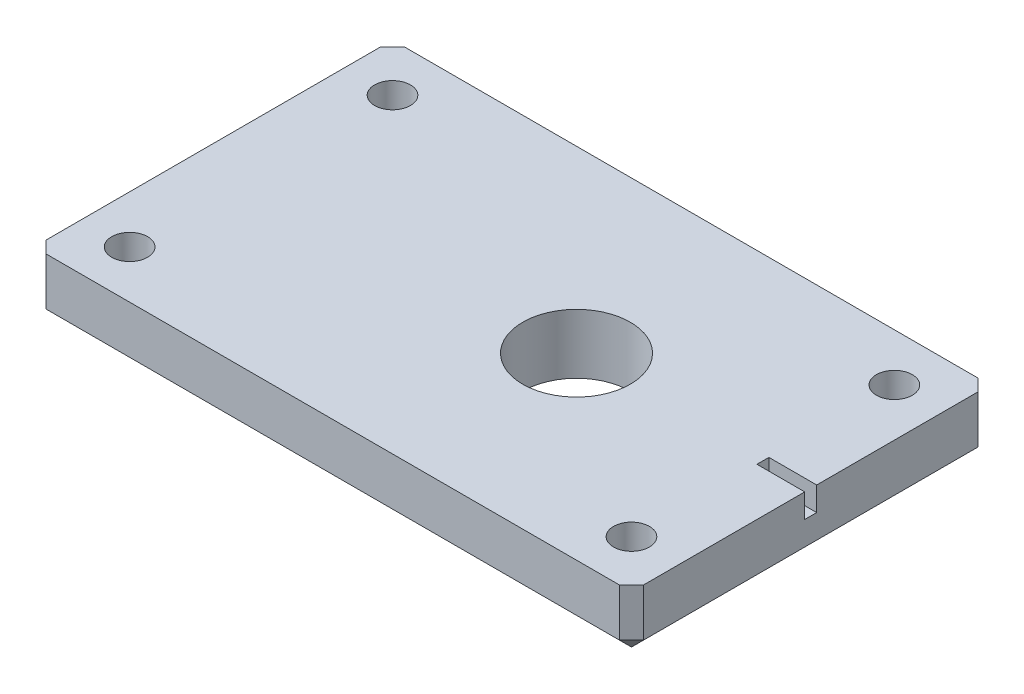
ISO-10303-21;
HEADER;
FILE_DESCRIPTION(('STEP AP214'),'2;1');
FILE_NAME('part.step','',(''),(''),'','','');
FILE_SCHEMA(('AUTOMOTIVE_DESIGN { 1 0 10303 214 1 1 1 1 }'));
ENDSEC;
DATA;
#1=APPLICATION_CONTEXT('core data for automotive mechanical design processes');
#2=APPLICATION_PROTOCOL_DEFINITION('international standard','automotive_design',2000,#1);
#3=PRODUCT_CONTEXT('',#1,'mechanical');
#4=PRODUCT('Part','Part','',(#3));
#5=PRODUCT_RELATED_PRODUCT_CATEGORY('part','',(#4));
#6=PRODUCT_DEFINITION_FORMATION('','',#4);
#7=PRODUCT_DEFINITION_CONTEXT('part definition',#1,'design');
#8=PRODUCT_DEFINITION('design','',#6,#7);
#9=PRODUCT_DEFINITION_SHAPE('','',#8);
#10=(LENGTH_UNIT() NAMED_UNIT(*) SI_UNIT(.MILLI.,.METRE.));
#11=(NAMED_UNIT(*) PLANE_ANGLE_UNIT() SI_UNIT($,.RADIAN.));
#12=(NAMED_UNIT(*) SI_UNIT($,.STERADIAN.) SOLID_ANGLE_UNIT());
#13=UNCERTAINTY_MEASURE_WITH_UNIT(LENGTH_MEASURE(1.E-05),#10,'distance_accuracy_value','');
#14=(GEOMETRIC_REPRESENTATION_CONTEXT(3) GLOBAL_UNCERTAINTY_ASSIGNED_CONTEXT((#13)) GLOBAL_UNIT_ASSIGNED_CONTEXT((#10,
#11,#12)) REPRESENTATION_CONTEXT('',''));
#15=CARTESIAN_POINT('',(0.,0.,0.));
#16=DIRECTION('',(0.,0.,1.));
#17=DIRECTION('',(1.,0.,0.));
#18=AXIS2_PLACEMENT_3D('',#15,#16,#17);
#19=CARTESIAN_POINT('',(25.,5.,-15.));
#20=DIRECTION('',(-1.,0.,0.));
#21=DIRECTION('',(0.,0.,1.));
#22=AXIS2_PLACEMENT_3D('',#19,#20,#21);
#23=PLANE('',#22);
#24=DIRECTION('',(0.,0.,-1.));
#25=VECTOR('',#24,1.);
#26=CARTESIAN_POINT('',(25.,5.,-15.));
#27=LINE('',#26,#25);
#28=CARTESIAN_POINT('',(25.,5.,14.));
#29=VERTEX_POINT('',#28);
#30=CARTESIAN_POINT('',(25.,5.,0.499999999999993));
#31=VERTEX_POINT('',#30);
#32=EDGE_CURVE('E170',#29,#31,#27,.T.);
#33=ORIENTED_EDGE('',*,*,#32,.F.);
#34=DIRECTION('',(0.,-1.,0.));
#35=VECTOR('',#34,1.);
#36=CARTESIAN_POINT('',(25.,5.,14.));
#37=LINE('',#36,#35);
#38=CARTESIAN_POINT('',(25.,1.00000000000001,14.));
#39=VERTEX_POINT('',#38);
#40=EDGE_CURVE('E230',#29,#39,#37,.T.);
#41=ORIENTED_EDGE('',*,*,#40,.T.);
#42=DIRECTION('',(0.,0.,-1.));
#43=VECTOR('',#42,1.);
#44=CARTESIAN_POINT('',(25.,1.00000000000001,-15.));
#45=LINE('',#44,#43);
#46=CARTESIAN_POINT('',(25.,1.00000000000001,-14.));
#47=VERTEX_POINT('',#46);
#48=EDGE_CURVE('E226',#39,#47,#45,.T.);
#49=ORIENTED_EDGE('',*,*,#48,.T.);
#50=DIRECTION('',(0.,1.,0.));
#51=VECTOR('',#50,1.);
#52=CARTESIAN_POINT('',(25.,5.,-14.));
#53=LINE('',#52,#51);
#54=CARTESIAN_POINT('',(25.,5.,-14.));
#55=VERTEX_POINT('',#54);
#56=EDGE_CURVE('E228',#47,#55,#53,.T.);
#57=ORIENTED_EDGE('',*,*,#56,.T.);
#58=CARTESIAN_POINT('',(25.,5.,-0.500000000000007));
#59=VERTEX_POINT('',#58);
#60=EDGE_CURVE('E163',#59,#55,#27,.T.);
#61=ORIENTED_EDGE('',*,*,#60,.F.);
#62=DIRECTION('',(0.,1.,0.));
#63=VECTOR('',#62,1.);
#64=CARTESIAN_POINT('',(25.,3.,-0.500000000000007));
#65=LINE('',#64,#63);
#66=CARTESIAN_POINT('',(25.,3.,-0.500000000000007));
#67=VERTEX_POINT('',#66);
#68=EDGE_CURVE('E142',#67,#59,#65,.T.);
#69=ORIENTED_EDGE('',*,*,#68,.F.);
#70=DIRECTION('',(0.,0.,-1.));
#71=VECTOR('',#70,1.);
#72=CARTESIAN_POINT('',(25.,3.,-0.500000000000007));
#73=LINE('',#72,#71);
#74=CARTESIAN_POINT('',(25.,3.,0.499999999999993));
#75=VERTEX_POINT('',#74);
#76=EDGE_CURVE('E149',#75,#67,#73,.T.);
#77=ORIENTED_EDGE('',*,*,#76,.F.);
#78=DIRECTION('',(0.,1.,0.));
#79=VECTOR('',#78,1.);
#80=CARTESIAN_POINT('',(25.,3.,0.499999999999993));
#81=LINE('',#80,#79);
#82=EDGE_CURVE('E291',#75,#31,#81,.T.);
#83=ORIENTED_EDGE('',*,*,#82,.T.);
#84=EDGE_LOOP('',(#33,#41,#49,#57,#61,#69,#77,#83));
#85=FACE_BOUND('',#84,.T.);
#86=ADVANCED_FACE('F37',(#85),#23,.F.);
#87=CARTESIAN_POINT('',(-25.,5.,-15.));
#88=DIRECTION('',(0.,0.,1.));
#89=DIRECTION('',(1.,0.,0.));
#90=AXIS2_PLACEMENT_3D('',#87,#88,#89);
#91=PLANE('',#90);
#92=DIRECTION('',(-1.,0.,0.));
#93=VECTOR('',#92,1.);
#94=CARTESIAN_POINT('',(-25.,1.00000000000001,-15.));
#95=LINE('',#94,#93);
#96=CARTESIAN_POINT('',(24.,1.00000000000001,-15.));
#97=VERTEX_POINT('',#96);
#98=CARTESIAN_POINT('',(-24.,1.00000000000001,-15.));
#99=VERTEX_POINT('',#98);
#100=EDGE_CURVE('E206',#97,#99,#95,.T.);
#101=ORIENTED_EDGE('',*,*,#100,.T.);
#102=DIRECTION('',(0.,1.,0.));
#103=VECTOR('',#102,1.);
#104=CARTESIAN_POINT('',(-24.,5.,-15.));
#105=LINE('',#104,#103);
#106=CARTESIAN_POINT('',(-24.,5.,-15.));
#107=VERTEX_POINT('',#106);
#108=EDGE_CURVE('E210',#99,#107,#105,.T.);
#109=ORIENTED_EDGE('',*,*,#108,.T.);
#110=DIRECTION('',(-1.,0.,0.));
#111=VECTOR('',#110,1.);
#112=CARTESIAN_POINT('',(-25.,5.,-15.));
#113=LINE('',#112,#111);
#114=CARTESIAN_POINT('',(24.,5.,-15.));
#115=VERTEX_POINT('',#114);
#116=EDGE_CURVE('E172',#115,#107,#113,.T.);
#117=ORIENTED_EDGE('',*,*,#116,.F.);
#118=DIRECTION('',(0.,-1.,0.));
#119=VECTOR('',#118,1.);
#120=CARTESIAN_POINT('',(24.,5.,-15.));
#121=LINE('',#120,#119);
#122=EDGE_CURVE('E208',#115,#97,#121,.T.);
#123=ORIENTED_EDGE('',*,*,#122,.T.);
#124=EDGE_LOOP('',(#101,#109,#117,#123));
#125=FACE_BOUND('',#124,.T.);
#126=ADVANCED_FACE('F319',(#125),#91,.F.);
#127=CARTESIAN_POINT('',(-25.,5.,-15.));
#128=DIRECTION('',(1.,0.,0.));
#129=DIRECTION('',(0.,0.,-1.));
#130=AXIS2_PLACEMENT_3D('',#127,#128,#129);
#131=PLANE('',#130);
#132=DIRECTION('',(0.,0.,1.));
#133=VECTOR('',#132,1.);
#134=CARTESIAN_POINT('',(-25.,5.,-15.));
#135=LINE('',#134,#133);
#136=CARTESIAN_POINT('',(-25.,5.,-14.));
#137=VERTEX_POINT('',#136);
#138=CARTESIAN_POINT('',(-25.,5.,14.));
#139=VERTEX_POINT('',#138);
#140=EDGE_CURVE('E175',#137,#139,#135,.T.);
#141=ORIENTED_EDGE('',*,*,#140,.F.);
#142=DIRECTION('',(0.,-1.,0.));
#143=VECTOR('',#142,1.);
#144=CARTESIAN_POINT('',(-25.,5.,-14.));
#145=LINE('',#144,#143);
#146=CARTESIAN_POINT('',(-25.,1.00000000000001,-14.));
#147=VERTEX_POINT('',#146);
#148=EDGE_CURVE('E203',#137,#147,#145,.T.);
#149=ORIENTED_EDGE('',*,*,#148,.T.);
#150=DIRECTION('',(0.,0.,1.));
#151=VECTOR('',#150,1.);
#152=CARTESIAN_POINT('',(-25.,1.00000000000001,-15.));
#153=LINE('',#152,#151);
#154=CARTESIAN_POINT('',(-25.,1.00000000000001,14.));
#155=VERTEX_POINT('',#154);
#156=EDGE_CURVE('E181',#147,#155,#153,.T.);
#157=ORIENTED_EDGE('',*,*,#156,.T.);
#158=DIRECTION('',(0.,1.,0.));
#159=VECTOR('',#158,1.);
#160=CARTESIAN_POINT('',(-25.,5.,14.));
#161=LINE('',#160,#159);
#162=EDGE_CURVE('E201',#155,#139,#161,.T.);
#163=ORIENTED_EDGE('',*,*,#162,.T.);
#164=EDGE_LOOP('',(#141,#149,#157,#163));
#165=FACE_BOUND('',#164,.T.);
#166=ADVANCED_FACE('F339',(#165),#131,.F.);
#167=CARTESIAN_POINT('',(-25.,5.,15.));
#168=DIRECTION('',(0.,0.,-1.));
#169=DIRECTION('',(-1.,0.,0.));
#170=AXIS2_PLACEMENT_3D('',#167,#168,#169);
#171=PLANE('',#170);
#172=DIRECTION('',(1.,0.,0.));
#173=VECTOR('',#172,1.);
#174=CARTESIAN_POINT('',(-25.,5.,15.));
#175=LINE('',#174,#173);
#176=CARTESIAN_POINT('',(-24.,5.,15.));
#177=VERTEX_POINT('',#176);
#178=CARTESIAN_POINT('',(24.,5.,15.));
#179=VERTEX_POINT('',#178);
#180=EDGE_CURVE('E178',#177,#179,#175,.T.);
#181=ORIENTED_EDGE('',*,*,#180,.F.);
#182=DIRECTION('',(0.,-1.,0.));
#183=VECTOR('',#182,1.);
#184=CARTESIAN_POINT('',(-24.,5.,15.));
#185=LINE('',#184,#183);
#186=CARTESIAN_POINT('',(-24.,1.00000000000001,15.));
#187=VERTEX_POINT('',#186);
#188=EDGE_CURVE('E224',#177,#187,#185,.T.);
#189=ORIENTED_EDGE('',*,*,#188,.T.);
#190=DIRECTION('',(1.,0.,0.));
#191=VECTOR('',#190,1.);
#192=CARTESIAN_POINT('',(-25.,1.00000000000001,15.));
#193=LINE('',#192,#191);
#194=CARTESIAN_POINT('',(24.,1.00000000000001,15.));
#195=VERTEX_POINT('',#194);
#196=EDGE_CURVE('E220',#187,#195,#193,.T.);
#197=ORIENTED_EDGE('',*,*,#196,.T.);
#198=DIRECTION('',(0.,1.,0.));
#199=VECTOR('',#198,1.);
#200=CARTESIAN_POINT('',(24.,5.,15.));
#201=LINE('',#200,#199);
#202=EDGE_CURVE('E222',#195,#179,#201,.T.);
#203=ORIENTED_EDGE('',*,*,#202,.T.);
#204=EDGE_LOOP('',(#181,#189,#197,#203));
#205=FACE_BOUND('',#204,.T.);
#206=ADVANCED_FACE('F347',(#205),#171,.F.);
#207=CARTESIAN_POINT('',(0.,5.,0.));
#208=DIRECTION('',(0.,1.,0.));
#209=DIRECTION('',(0.,0.,1.));
#210=AXIS2_PLACEMENT_3D('',#207,#208,#209);
#211=PLANE('',#210);
#212=CARTESIAN_POINT('',(-21.,5.,11.));
#213=DIRECTION('',(0.,1.,0.));
#214=DIRECTION('',(0.,0.,-1.));
#215=AXIS2_PLACEMENT_3D('',#212,#213,#214);
#216=CIRCLE('',#215,1.5);
#217=CARTESIAN_POINT('',(-21.,5.,9.50000000000001));
#218=VERTEX_POINT('',#217);
#219=EDGE_CURVE('E268',#218,#218,#216,.T.);
#220=ORIENTED_EDGE('',*,*,#219,.F.);
#221=EDGE_LOOP('',(#220));
#222=FACE_BOUND('',#221,.T.);
#223=CARTESIAN_POINT('',(21.,5.,11.));
#224=DIRECTION('',(0.,1.,0.));
#225=DIRECTION('',(0.,0.,1.));
#226=AXIS2_PLACEMENT_3D('',#223,#224,#225);
#227=CIRCLE('',#226,1.5);
#228=CARTESIAN_POINT('',(21.,5.,12.5));
#229=VERTEX_POINT('',#228);
#230=EDGE_CURVE('E273',#229,#229,#227,.T.);
#231=ORIENTED_EDGE('',*,*,#230,.F.);
#232=EDGE_LOOP('',(#231));
#233=FACE_BOUND('',#232,.T.);
#234=CARTESIAN_POINT('',(21.,5.,-11.));
#235=DIRECTION('',(0.,1.,0.));
#236=DIRECTION('',(0.,0.,-1.));
#237=AXIS2_PLACEMENT_3D('',#234,#235,#236);
#238=CIRCLE('',#237,1.5);
#239=CARTESIAN_POINT('',(21.,5.,-12.5));
#240=VERTEX_POINT('',#239);
#241=EDGE_CURVE('E278',#240,#240,#238,.T.);
#242=ORIENTED_EDGE('',*,*,#241,.F.);
#243=EDGE_LOOP('',(#242));
#244=FACE_BOUND('',#243,.T.);
#245=CARTESIAN_POINT('',(-21.,5.,-11.));
#246=DIRECTION('',(0.,1.,0.));
#247=DIRECTION('',(0.,0.,1.));
#248=AXIS2_PLACEMENT_3D('',#245,#246,#247);
#249=CIRCLE('',#248,1.5);
#250=CARTESIAN_POINT('',(-21.,5.,-9.5));
#251=VERTEX_POINT('',#250);
#252=EDGE_CURVE('E191',#251,#251,#249,.T.);
#253=ORIENTED_EDGE('',*,*,#252,.F.);
#254=EDGE_LOOP('',(#253));
#255=FACE_BOUND('',#254,.T.);
#256=CARTESIAN_POINT('',(5.4,5.,0.));
#257=DIRECTION('',(0.,1.,0.));
#258=DIRECTION('',(0.,0.,1.));
#259=AXIS2_PLACEMENT_3D('',#256,#257,#258);
#260=CIRCLE('',#259,4.5);
#261=CARTESIAN_POINT('',(5.4,5.,4.5));
#262=VERTEX_POINT('',#261);
#263=EDGE_CURVE('E186',#262,#262,#260,.T.);
#264=ORIENTED_EDGE('',*,*,#263,.F.);
#265=EDGE_LOOP('',(#264));
#266=FACE_BOUND('',#265,.T.);
#267=ORIENTED_EDGE('',*,*,#116,.T.);
#268=DIRECTION('',(0.707106781186545,0.,-0.70710678118655));
#269=VECTOR('',#268,1.);
#270=CARTESIAN_POINT('',(-19.5000000000001,5.,-19.4999999999999));
#271=LINE('',#270,#269);
#272=EDGE_CURVE('E218',#107,#137,#271,.F.);
#273=ORIENTED_EDGE('',*,*,#272,.T.);
#274=ORIENTED_EDGE('',*,*,#140,.T.);
#275=DIRECTION('',(-0.707106781186545,0.,-0.70710678118655));
#276=VECTOR('',#275,1.);
#277=CARTESIAN_POINT('',(-19.5000000000001,5.,19.4999999999999));
#278=LINE('',#277,#276);
#279=EDGE_CURVE('E216',#139,#177,#278,.F.);
#280=ORIENTED_EDGE('',*,*,#279,.T.);
#281=ORIENTED_EDGE('',*,*,#180,.T.);
#282=DIRECTION('',(-0.70710678118655,0.,0.707106781186545));
#283=VECTOR('',#282,1.);
#284=CARTESIAN_POINT('',(19.4999999999999,5.,19.5));
#285=LINE('',#284,#283);
#286=EDGE_CURVE('E214',#179,#29,#285,.F.);
#287=ORIENTED_EDGE('',*,*,#286,.T.);
#288=ORIENTED_EDGE('',*,*,#32,.T.);
#289=DIRECTION('',(1.,0.,0.));
#290=VECTOR('',#289,1.);
#291=CARTESIAN_POINT('',(21.,5.,0.499999999999993));
#292=LINE('',#291,#290);
#293=CARTESIAN_POINT('',(21.,5.,0.499999999999993));
#294=VERTEX_POINT('',#293);
#295=EDGE_CURVE('E158',#294,#31,#292,.T.);
#296=ORIENTED_EDGE('',*,*,#295,.F.);
#297=DIRECTION('',(0.,0.,1.));
#298=VECTOR('',#297,1.);
#299=CARTESIAN_POINT('',(21.,5.,-0.500000000000007));
#300=LINE('',#299,#298);
#301=CARTESIAN_POINT('',(21.,5.,-0.500000000000007));
#302=VERTEX_POINT('',#301);
#303=EDGE_CURVE('E286',#302,#294,#300,.T.);
#304=ORIENTED_EDGE('',*,*,#303,.F.);
#305=DIRECTION('',(-1.,0.,0.));
#306=VECTOR('',#305,1.);
#307=CARTESIAN_POINT('',(21.,5.,-0.500000000000007));
#308=LINE('',#307,#306);
#309=EDGE_CURVE('E185',#59,#302,#308,.T.);
#310=ORIENTED_EDGE('',*,*,#309,.F.);
#311=ORIENTED_EDGE('',*,*,#60,.T.);
#312=DIRECTION('',(0.707106781186545,0.,0.70710678118655));
#313=VECTOR('',#312,1.);
#314=CARTESIAN_POINT('',(19.5000000000001,5.,-19.4999999999999));
#315=LINE('',#314,#313);
#316=EDGE_CURVE('E212',#55,#115,#315,.F.);
#317=ORIENTED_EDGE('',*,*,#316,.T.);
#318=EDGE_LOOP('',(#267,#273,#274,#280,#281,#287,#288,#296,#304,#310,#311,#317));
#319=FACE_BOUND('',#318,.T.);
#320=ADVANCED_FACE('F299',(#222,#233,#244,#255,#266,#319),#211,.T.);
#321=CARTESIAN_POINT('',(0.,0.,0.));
#322=DIRECTION('',(0.,1.,0.));
#323=DIRECTION('',(0.,0.,1.));
#324=AXIS2_PLACEMENT_3D('',#321,#322,#323);
#325=PLANE('',#324);
#326=DIRECTION('',(-1.,0.,0.));
#327=VECTOR('',#326,1.);
#328=CARTESIAN_POINT('',(0.,0.,14.));
#329=LINE('',#328,#327);
#330=CARTESIAN_POINT('',(24.,0.,14.));
#331=VERTEX_POINT('',#330);
#332=CARTESIAN_POINT('',(-24.,0.,14.));
#333=VERTEX_POINT('',#332);
#334=EDGE_CURVE('E46',#331,#333,#329,.T.);
#335=ORIENTED_EDGE('',*,*,#334,.T.);
#336=DIRECTION('',(0.,0.,-1.));
#337=VECTOR('',#336,1.);
#338=CARTESIAN_POINT('',(-24.,0.,0.));
#339=LINE('',#338,#337);
#340=CARTESIAN_POINT('',(-24.,0.,-14.));
#341=VERTEX_POINT('',#340);
#342=EDGE_CURVE('E11',#333,#341,#339,.T.);
#343=ORIENTED_EDGE('',*,*,#342,.T.);
#344=DIRECTION('',(1.,0.,0.));
#345=VECTOR('',#344,1.);
#346=CARTESIAN_POINT('',(0.,0.,-14.));
#347=LINE('',#346,#345);
#348=CARTESIAN_POINT('',(24.,0.,-14.));
#349=VERTEX_POINT('',#348);
#350=EDGE_CURVE('E232',#341,#349,#347,.T.);
#351=ORIENTED_EDGE('',*,*,#350,.T.);
#352=DIRECTION('',(0.,0.,1.));
#353=VECTOR('',#352,1.);
#354=CARTESIAN_POINT('',(24.,0.,0.));
#355=LINE('',#354,#353);
#356=EDGE_CURVE('E57',#349,#331,#355,.T.);
#357=ORIENTED_EDGE('',*,*,#356,.T.);
#358=EDGE_LOOP('',(#335,#343,#351,#357));
#359=FACE_BOUND('',#358,.T.);
#360=CARTESIAN_POINT('',(-21.,0.,11.));
#361=DIRECTION('',(0.,1.,0.));
#362=DIRECTION('',(0.,0.,1.));
#363=AXIS2_PLACEMENT_3D('',#360,#361,#362);
#364=CIRCLE('',#363,1.5);
#365=CARTESIAN_POINT('',(-21.,0.,12.5));
#366=VERTEX_POINT('',#365);
#367=EDGE_CURVE('E197',#366,#366,#364,.T.);
#368=ORIENTED_EDGE('',*,*,#367,.T.);
#369=EDGE_LOOP('',(#368));
#370=FACE_BOUND('',#369,.T.);
#371=CARTESIAN_POINT('',(21.,0.,11.));
#372=DIRECTION('',(0.,1.,0.));
#373=DIRECTION('',(0.,0.,1.));
#374=AXIS2_PLACEMENT_3D('',#371,#372,#373);
#375=CIRCLE('',#374,1.5);
#376=CARTESIAN_POINT('',(21.,0.,12.5));
#377=VERTEX_POINT('',#376);
#378=EDGE_CURVE('E194',#377,#377,#375,.T.);
#379=ORIENTED_EDGE('',*,*,#378,.T.);
#380=EDGE_LOOP('',(#379));
#381=FACE_BOUND('',#380,.T.);
#382=CARTESIAN_POINT('',(21.,0.,-11.));
#383=DIRECTION('',(0.,1.,0.));
#384=DIRECTION('',(0.,0.,1.));
#385=AXIS2_PLACEMENT_3D('',#382,#383,#384);
#386=CIRCLE('',#385,1.5);
#387=CARTESIAN_POINT('',(21.,0.,-9.50000000000001));
#388=VERTEX_POINT('',#387);
#389=EDGE_CURVE('E190',#388,#388,#386,.T.);
#390=ORIENTED_EDGE('',*,*,#389,.T.);
#391=EDGE_LOOP('',(#390));
#392=FACE_BOUND('',#391,.T.);
#393=CARTESIAN_POINT('',(-21.,0.,-11.));
#394=DIRECTION('',(0.,1.,0.));
#395=DIRECTION('',(0.,0.,1.));
#396=AXIS2_PLACEMENT_3D('',#393,#394,#395);
#397=CIRCLE('',#396,1.5);
#398=CARTESIAN_POINT('',(-21.,0.,-9.5));
#399=VERTEX_POINT('',#398);
#400=EDGE_CURVE('E187',#399,#399,#397,.T.);
#401=ORIENTED_EDGE('',*,*,#400,.T.);
#402=EDGE_LOOP('',(#401));
#403=FACE_BOUND('',#402,.T.);
#404=CARTESIAN_POINT('',(5.4,0.,0.));
#405=DIRECTION('',(0.,1.,0.));
#406=DIRECTION('',(0.,0.,1.));
#407=AXIS2_PLACEMENT_3D('',#404,#405,#406);
#408=CIRCLE('',#407,4.5);
#409=CARTESIAN_POINT('',(5.4,0.,4.5));
#410=VERTEX_POINT('',#409);
#411=EDGE_CURVE('E182',#410,#410,#408,.T.);
#412=ORIENTED_EDGE('',*,*,#411,.T.);
#413=EDGE_LOOP('',(#412));
#414=FACE_BOUND('',#413,.T.);
#415=ADVANCED_FACE('F351',(#359,#370,#381,#392,#403,#414),#325,.F.);
#416=CARTESIAN_POINT('',(21.,3.,0.499999999999993));
#417=DIRECTION('',(0.,0.,1.));
#418=DIRECTION('',(1.,0.,0.));
#419=AXIS2_PLACEMENT_3D('',#416,#417,#418);
#420=PLANE('',#419);
#421=ORIENTED_EDGE('',*,*,#295,.T.);
#422=ORIENTED_EDGE('',*,*,#82,.F.);
#423=DIRECTION('',(1.,0.,0.));
#424=VECTOR('',#423,1.);
#425=CARTESIAN_POINT('',(21.,3.,0.499999999999993));
#426=LINE('',#425,#424);
#427=CARTESIAN_POINT('',(21.,3.,0.499999999999993));
#428=VERTEX_POINT('',#427);
#429=EDGE_CURVE('E155',#428,#75,#426,.T.);
#430=ORIENTED_EDGE('',*,*,#429,.F.);
#431=DIRECTION('',(0.,1.,0.));
#432=VECTOR('',#431,1.);
#433=CARTESIAN_POINT('',(21.,3.,0.499999999999993));
#434=LINE('',#433,#432);
#435=EDGE_CURVE('E165',#428,#294,#434,.T.);
#436=ORIENTED_EDGE('',*,*,#435,.T.);
#437=EDGE_LOOP('',(#421,#422,#430,#436));
#438=FACE_BOUND('',#437,.T.);
#439=ADVANCED_FACE('F293',(#438),#420,.F.);
#440=CARTESIAN_POINT('',(21.,3.,-0.500000000000007));
#441=DIRECTION('',(-1.,0.,0.));
#442=DIRECTION('',(0.,0.,1.));
#443=AXIS2_PLACEMENT_3D('',#440,#441,#442);
#444=PLANE('',#443);
#445=ORIENTED_EDGE('',*,*,#303,.T.);
#446=ORIENTED_EDGE('',*,*,#435,.F.);
#447=DIRECTION('',(0.,0.,1.));
#448=VECTOR('',#447,1.);
#449=CARTESIAN_POINT('',(21.,3.,-0.500000000000007));
#450=LINE('',#449,#448);
#451=CARTESIAN_POINT('',(21.,3.,-0.500000000000007));
#452=VERTEX_POINT('',#451);
#453=EDGE_CURVE('E148',#452,#428,#450,.T.);
#454=ORIENTED_EDGE('',*,*,#453,.F.);
#455=DIRECTION('',(0.,1.,0.));
#456=VECTOR('',#455,1.);
#457=CARTESIAN_POINT('',(21.,3.,-0.500000000000007));
#458=LINE('',#457,#456);
#459=EDGE_CURVE('E144',#452,#302,#458,.T.);
#460=ORIENTED_EDGE('',*,*,#459,.T.);
#461=EDGE_LOOP('',(#445,#446,#454,#460));
#462=FACE_BOUND('',#461,.T.);
#463=ADVANCED_FACE('F297',(#462),#444,.F.);
#464=CARTESIAN_POINT('',(21.,3.,-0.500000000000007));
#465=DIRECTION('',(0.,0.,-1.));
#466=DIRECTION('',(-1.,0.,0.));
#467=AXIS2_PLACEMENT_3D('',#464,#465,#466);
#468=PLANE('',#467);
#469=ORIENTED_EDGE('',*,*,#309,.T.);
#470=ORIENTED_EDGE('',*,*,#459,.F.);
#471=DIRECTION('',(-1.,0.,0.));
#472=VECTOR('',#471,1.);
#473=CARTESIAN_POINT('',(21.,3.,-0.500000000000007));
#474=LINE('',#473,#472);
#475=EDGE_CURVE('E137',#67,#452,#474,.T.);
#476=ORIENTED_EDGE('',*,*,#475,.F.);
#477=ORIENTED_EDGE('',*,*,#68,.T.);
#478=EDGE_LOOP('',(#469,#470,#476,#477));
#479=FACE_BOUND('',#478,.T.);
#480=ADVANCED_FACE('F140',(#479),#468,.F.);
#481=CARTESIAN_POINT('',(0.,3.,0.));
#482=DIRECTION('',(0.,1.,0.));
#483=DIRECTION('',(0.,0.,1.));
#484=AXIS2_PLACEMENT_3D('',#481,#482,#483);
#485=PLANE('',#484);
#486=ORIENTED_EDGE('',*,*,#76,.T.);
#487=ORIENTED_EDGE('',*,*,#475,.T.);
#488=ORIENTED_EDGE('',*,*,#453,.T.);
#489=ORIENTED_EDGE('',*,*,#429,.T.);
#490=EDGE_LOOP('',(#486,#487,#488,#489));
#491=FACE_BOUND('',#490,.T.);
#492=ADVANCED_FACE('F153',(#491),#485,.T.);
#493=CARTESIAN_POINT('',(5.4,-17.,0.));
#494=DIRECTION('',(0.,1.,0.));
#495=DIRECTION('',(0.,0.,1.));
#496=AXIS2_PLACEMENT_3D('',#493,#494,#495);
#497=CYLINDRICAL_SURFACE('',#496,4.5);
#498=ORIENTED_EDGE('',*,*,#263,.T.);
#499=EDGE_LOOP('',(#498));
#500=FACE_BOUND('',#499,.T.);
#501=ORIENTED_EDGE('',*,*,#411,.F.);
#502=EDGE_LOOP('',(#501));
#503=FACE_BOUND('',#502,.T.);
#504=ADVANCED_FACE('F535',(#500,#503),#497,.F.);
#505=CARTESIAN_POINT('',(-21.,-17.,-11.));
#506=DIRECTION('',(0.,1.,0.));
#507=DIRECTION('',(0.,0.,1.));
#508=AXIS2_PLACEMENT_3D('',#505,#506,#507);
#509=CYLINDRICAL_SURFACE('',#508,1.5);
#510=ORIENTED_EDGE('',*,*,#252,.T.);
#511=EDGE_LOOP('',(#510));
#512=FACE_BOUND('',#511,.T.);
#513=ORIENTED_EDGE('',*,*,#400,.F.);
#514=EDGE_LOOP('',(#513));
#515=FACE_BOUND('',#514,.T.);
#516=ADVANCED_FACE('F525',(#512,#515),#509,.F.);
#517=CARTESIAN_POINT('',(21.,-17.,-11.));
#518=DIRECTION('',(0.,1.,0.));
#519=DIRECTION('',(0.,0.,1.));
#520=AXIS2_PLACEMENT_3D('',#517,#518,#519);
#521=CYLINDRICAL_SURFACE('',#520,1.5);
#522=ORIENTED_EDGE('',*,*,#241,.T.);
#523=EDGE_LOOP('',(#522));
#524=FACE_BOUND('',#523,.T.);
#525=ORIENTED_EDGE('',*,*,#389,.F.);
#526=EDGE_LOOP('',(#525));
#527=FACE_BOUND('',#526,.T.);
#528=ADVANCED_FACE('F515',(#524,#527),#521,.F.);
#529=CARTESIAN_POINT('',(21.,-17.,11.));
#530=DIRECTION('',(0.,1.,0.));
#531=DIRECTION('',(0.,0.,1.));
#532=AXIS2_PLACEMENT_3D('',#529,#530,#531);
#533=CYLINDRICAL_SURFACE('',#532,1.5);
#534=ORIENTED_EDGE('',*,*,#230,.T.);
#535=EDGE_LOOP('',(#534));
#536=FACE_BOUND('',#535,.T.);
#537=ORIENTED_EDGE('',*,*,#378,.F.);
#538=EDGE_LOOP('',(#537));
#539=FACE_BOUND('',#538,.T.);
#540=ADVANCED_FACE('F506',(#536,#539),#533,.F.);
#541=CARTESIAN_POINT('',(-21.,-17.,11.));
#542=DIRECTION('',(0.,1.,0.));
#543=DIRECTION('',(0.,0.,1.));
#544=AXIS2_PLACEMENT_3D('',#541,#542,#543);
#545=CYLINDRICAL_SURFACE('',#544,1.5);
#546=ORIENTED_EDGE('',*,*,#219,.T.);
#547=EDGE_LOOP('',(#546));
#548=FACE_BOUND('',#547,.T.);
#549=ORIENTED_EDGE('',*,*,#367,.F.);
#550=EDGE_LOOP('',(#549));
#551=FACE_BOUND('',#550,.T.);
#552=ADVANCED_FACE('F454',(#548,#551),#545,.F.);
#553=CARTESIAN_POINT('',(25.,5.,14.));
#554=DIRECTION('',(-0.707106781186545,0.,-0.70710678118655));
#555=DIRECTION('',(0.,-1.,0.));
#556=AXIS2_PLACEMENT_3D('',#553,#554,#555);
#557=PLANE('',#556);
#558=DIRECTION('',(0.70710678118655,0.,-0.707106781186545));
#559=VECTOR('',#558,1.);
#560=CARTESIAN_POINT('',(25.,1.00000000000001,14.));
#561=LINE('',#560,#559);
#562=EDGE_CURVE('E41',#39,#195,#561,.F.);
#563=ORIENTED_EDGE('',*,*,#562,.F.);
#564=ORIENTED_EDGE('',*,*,#40,.F.);
#565=ORIENTED_EDGE('',*,*,#286,.F.);
#566=ORIENTED_EDGE('',*,*,#202,.F.);
#567=EDGE_LOOP('',(#563,#564,#565,#566));
#568=FACE_BOUND('',#567,.T.);
#569=ADVANCED_FACE('F39',(#568),#557,.F.);
#570=CARTESIAN_POINT('',(25.,1.00000000000001,14.));
#571=DIRECTION('',(0.577350269189622,-0.577350269189629,0.577350269189626));
#572=DIRECTION('',(0.,-0.707106781186546,-0.707106781186549));
#573=AXIS2_PLACEMENT_3D('',#570,#571,#572);
#574=PLANE('',#573);
#575=DIRECTION('',(-0.707106781186548,-0.707106781186547,0.));
#576=VECTOR('',#575,1.);
#577=CARTESIAN_POINT('',(25.,1.00000000000001,14.));
#578=LINE('',#577,#576);
#579=EDGE_CURVE('E261',#39,#331,#578,.T.);
#580=ORIENTED_EDGE('',*,*,#579,.F.);
#581=ORIENTED_EDGE('',*,*,#562,.T.);
#582=DIRECTION('',(0.,0.707106781186545,0.70710678118655));
#583=VECTOR('',#582,1.);
#584=CARTESIAN_POINT('',(24.,0.500000000000002,14.5));
#585=LINE('',#584,#583);
#586=EDGE_CURVE('E262',#331,#195,#585,.T.);
#587=ORIENTED_EDGE('',*,*,#586,.F.);
#588=EDGE_LOOP('',(#580,#581,#587));
#589=FACE_BOUND('',#588,.T.);
#590=ADVANCED_FACE('F305',(#589),#574,.T.);
#591=CARTESIAN_POINT('',(-24.,5.,15.));
#592=DIRECTION('',(0.70710678118655,0.,-0.707106781186545));
#593=DIRECTION('',(0.,-1.,0.));
#594=AXIS2_PLACEMENT_3D('',#591,#592,#593);
#595=PLANE('',#594);
#596=ORIENTED_EDGE('',*,*,#279,.F.);
#597=ORIENTED_EDGE('',*,*,#162,.F.);
#598=DIRECTION('',(0.707106781186545,0.,0.70710678118655));
#599=VECTOR('',#598,1.);
#600=CARTESIAN_POINT('',(-24.,1.00000000000001,15.));
#601=LINE('',#600,#599);
#602=EDGE_CURVE('E258',#187,#155,#601,.F.);
#603=ORIENTED_EDGE('',*,*,#602,.F.);
#604=ORIENTED_EDGE('',*,*,#188,.F.);
#605=EDGE_LOOP('',(#596,#597,#603,#604));
#606=FACE_BOUND('',#605,.T.);
#607=ADVANCED_FACE('F344',(#606),#595,.F.);
#608=CARTESIAN_POINT('',(-25.,1.00000000000001,15.));
#609=DIRECTION('',(0.,0.70710678118655,-0.707106781186545));
#610=DIRECTION('',(1.,0.,0.));
#611=AXIS2_PLACEMENT_3D('',#608,#609,#610);
#612=PLANE('',#611);
#613=ORIENTED_EDGE('',*,*,#586,.T.);
#614=ORIENTED_EDGE('',*,*,#196,.F.);
#615=DIRECTION('',(0.,-0.707106781186545,-0.70710678118655));
#616=VECTOR('',#615,1.);
#617=CARTESIAN_POINT('',(-24.,1.00000000000001,15.));
#618=LINE('',#617,#616);
#619=EDGE_CURVE('E255',#333,#187,#618,.F.);
#620=ORIENTED_EDGE('',*,*,#619,.F.);
#621=ORIENTED_EDGE('',*,*,#334,.F.);
#622=EDGE_LOOP('',(#613,#614,#620,#621));
#623=FACE_BOUND('',#622,.T.);
#624=ADVANCED_FACE('F348',(#623),#612,.F.);
#625=CARTESIAN_POINT('',(25.,1.00000000000001,-15.));
#626=DIRECTION('',(-0.707106781186547,0.707106781186548,0.));
#627=DIRECTION('',(0.,0.,-1.));
#628=AXIS2_PLACEMENT_3D('',#625,#626,#627);
#629=PLANE('',#628);
#630=ORIENTED_EDGE('',*,*,#579,.T.);
#631=ORIENTED_EDGE('',*,*,#356,.F.);
#632=DIRECTION('',(0.707106781186548,0.707106781186547,0.));
#633=VECTOR('',#632,1.);
#634=CARTESIAN_POINT('',(24.5,0.500000000000005,-14.));
#635=LINE('',#634,#633);
#636=EDGE_CURVE('E252',#47,#349,#635,.F.);
#637=ORIENTED_EDGE('',*,*,#636,.F.);
#638=ORIENTED_EDGE('',*,*,#48,.F.);
#639=EDGE_LOOP('',(#630,#631,#637,#638));
#640=FACE_BOUND('',#639,.T.);
#641=ADVANCED_FACE('F308',(#640),#629,.F.);
#642=CARTESIAN_POINT('',(24.,5.,-15.));
#643=DIRECTION('',(-0.70710678118655,0.,0.707106781186545));
#644=DIRECTION('',(0.,-1.,0.));
#645=AXIS2_PLACEMENT_3D('',#642,#643,#644);
#646=PLANE('',#645);
#647=ORIENTED_EDGE('',*,*,#316,.F.);
#648=ORIENTED_EDGE('',*,*,#56,.F.);
#649=DIRECTION('',(-0.707106781186545,0.,-0.70710678118655));
#650=VECTOR('',#649,1.);
#651=CARTESIAN_POINT('',(24.,1.00000000000001,-15.));
#652=LINE('',#651,#650);
#653=EDGE_CURVE('E249',#97,#47,#652,.F.);
#654=ORIENTED_EDGE('',*,*,#653,.F.);
#655=ORIENTED_EDGE('',*,*,#122,.F.);
#656=EDGE_LOOP('',(#647,#648,#654,#655));
#657=FACE_BOUND('',#656,.T.);
#658=ADVANCED_FACE('F313',(#657),#646,.F.);
#659=CARTESIAN_POINT('',(-24.,1.00000000000001,15.));
#660=DIRECTION('',(-0.577350269189625,-0.577350269189631,0.577350269189621));
#661=DIRECTION('',(0.707106781186551,-0.707106781186544,0.));
#662=AXIS2_PLACEMENT_3D('',#659,#660,#661);
#663=PLANE('',#662);
#664=ORIENTED_EDGE('',*,*,#619,.T.);
#665=ORIENTED_EDGE('',*,*,#602,.T.);
#666=DIRECTION('',(-0.707106781186552,0.707106781186543,0.));
#667=VECTOR('',#666,1.);
#668=CARTESIAN_POINT('',(-24.5,0.500000000000003,14.));
#669=LINE('',#668,#667);
#670=EDGE_CURVE('E246',#333,#155,#669,.T.);
#671=ORIENTED_EDGE('',*,*,#670,.F.);
#672=EDGE_LOOP('',(#664,#665,#671));
#673=FACE_BOUND('',#672,.T.);
#674=ADVANCED_FACE('F350',(#673),#663,.T.);
#675=CARTESIAN_POINT('',(24.,1.00000000000001,-15.));
#676=DIRECTION('',(0.577350269189626,-0.577350269189628,-0.577350269189622));
#677=DIRECTION('',(0.707106781186549,0.707106781186546,0.));
#678=AXIS2_PLACEMENT_3D('',#675,#676,#677);
#679=PLANE('',#678);
#680=ORIENTED_EDGE('',*,*,#653,.T.);
#681=ORIENTED_EDGE('',*,*,#636,.T.);
#682=DIRECTION('',(0.,-0.707106781186545,0.70710678118655));
#683=VECTOR('',#682,1.);
#684=CARTESIAN_POINT('',(24.,1.00000000000001,-15.));
#685=LINE('',#684,#683);
#686=EDGE_CURVE('E243',#97,#349,#685,.T.);
#687=ORIENTED_EDGE('',*,*,#686,.F.);
#688=EDGE_LOOP('',(#680,#681,#687));
#689=FACE_BOUND('',#688,.T.);
#690=ADVANCED_FACE('F355',(#689),#679,.T.);
#691=CARTESIAN_POINT('',(-25.,1.00000000000001,-15.));
#692=DIRECTION('',(0.707106781186543,0.707106781186552,0.));
#693=DIRECTION('',(0.,0.,1.));
#694=AXIS2_PLACEMENT_3D('',#691,#692,#693);
#695=PLANE('',#694);
#696=ORIENTED_EDGE('',*,*,#670,.T.);
#697=ORIENTED_EDGE('',*,*,#156,.F.);
#698=DIRECTION('',(0.707106781186552,-0.707106781186543,0.));
#699=VECTOR('',#698,1.);
#700=CARTESIAN_POINT('',(-25.,1.00000000000001,-14.));
#701=LINE('',#700,#699);
#702=EDGE_CURVE('E240',#341,#147,#701,.F.);
#703=ORIENTED_EDGE('',*,*,#702,.F.);
#704=ORIENTED_EDGE('',*,*,#342,.F.);
#705=EDGE_LOOP('',(#696,#697,#703,#704));
#706=FACE_BOUND('',#705,.T.);
#707=ADVANCED_FACE('F334',(#706),#695,.F.);
#708=CARTESIAN_POINT('',(-25.,1.00000000000001,-15.));
#709=DIRECTION('',(0.,0.70710678118655,0.707106781186545));
#710=DIRECTION('',(-1.,0.,0.));
#711=AXIS2_PLACEMENT_3D('',#708,#709,#710);
#712=PLANE('',#711);
#713=ORIENTED_EDGE('',*,*,#686,.T.);
#714=ORIENTED_EDGE('',*,*,#350,.F.);
#715=DIRECTION('',(0.,0.707106781186545,-0.70710678118655));
#716=VECTOR('',#715,1.);
#717=CARTESIAN_POINT('',(-24.,0.500000000000006,-14.5));
#718=LINE('',#717,#716);
#719=EDGE_CURVE('E238',#99,#341,#718,.F.);
#720=ORIENTED_EDGE('',*,*,#719,.F.);
#721=ORIENTED_EDGE('',*,*,#100,.F.);
#722=EDGE_LOOP('',(#713,#714,#720,#721));
#723=FACE_BOUND('',#722,.T.);
#724=ADVANCED_FACE('F356',(#723),#712,.F.);
#725=CARTESIAN_POINT('',(-25.,1.00000000000001,-14.));
#726=DIRECTION('',(-0.577350269189625,-0.577350269189631,-0.577350269189621));
#727=DIRECTION('',(0.707106781186551,-0.707106781186544,0.));
#728=AXIS2_PLACEMENT_3D('',#725,#726,#727);
#729=PLANE('',#728);
#730=ORIENTED_EDGE('',*,*,#719,.T.);
#731=ORIENTED_EDGE('',*,*,#702,.T.);
#732=DIRECTION('',(-0.707106781186545,0.,0.70710678118655));
#733=VECTOR('',#732,1.);
#734=CARTESIAN_POINT('',(-25.,1.00000000000001,-14.));
#735=LINE('',#734,#733);
#736=EDGE_CURVE('E236',#99,#147,#735,.T.);
#737=ORIENTED_EDGE('',*,*,#736,.F.);
#738=EDGE_LOOP('',(#730,#731,#737));
#739=FACE_BOUND('',#738,.T.);
#740=ADVANCED_FACE('F328',(#739),#729,.T.);
#741=CARTESIAN_POINT('',(-25.,5.,-14.));
#742=DIRECTION('',(0.70710678118655,0.,0.707106781186545));
#743=DIRECTION('',(0.,-1.,0.));
#744=AXIS2_PLACEMENT_3D('',#741,#742,#743);
#745=PLANE('',#744);
#746=ORIENTED_EDGE('',*,*,#272,.F.);
#747=ORIENTED_EDGE('',*,*,#108,.F.);
#748=ORIENTED_EDGE('',*,*,#736,.T.);
#749=ORIENTED_EDGE('',*,*,#148,.F.);
#750=EDGE_LOOP('',(#746,#747,#748,#749));
#751=FACE_BOUND('',#750,.T.);
#752=ADVANCED_FACE('F325',(#751),#745,.F.);
#753=CLOSED_SHELL('',(#86,#126,#166,#206,#320,#415,#439,#463,#480,#492,#504,#516,#528,#540,#552,
#569,#590,#607,#624,#641,#658,#674,#690,#707,#724,#740,#752));
#754=MANIFOLD_SOLID_BREP('B2',#753);
#755=ADVANCED_BREP_SHAPE_REPRESENTATION('',(#18,#754),#14);
#756=SHAPE_DEFINITION_REPRESENTATION(#9,#755);
ENDSEC;
END-ISO-10303-21;
